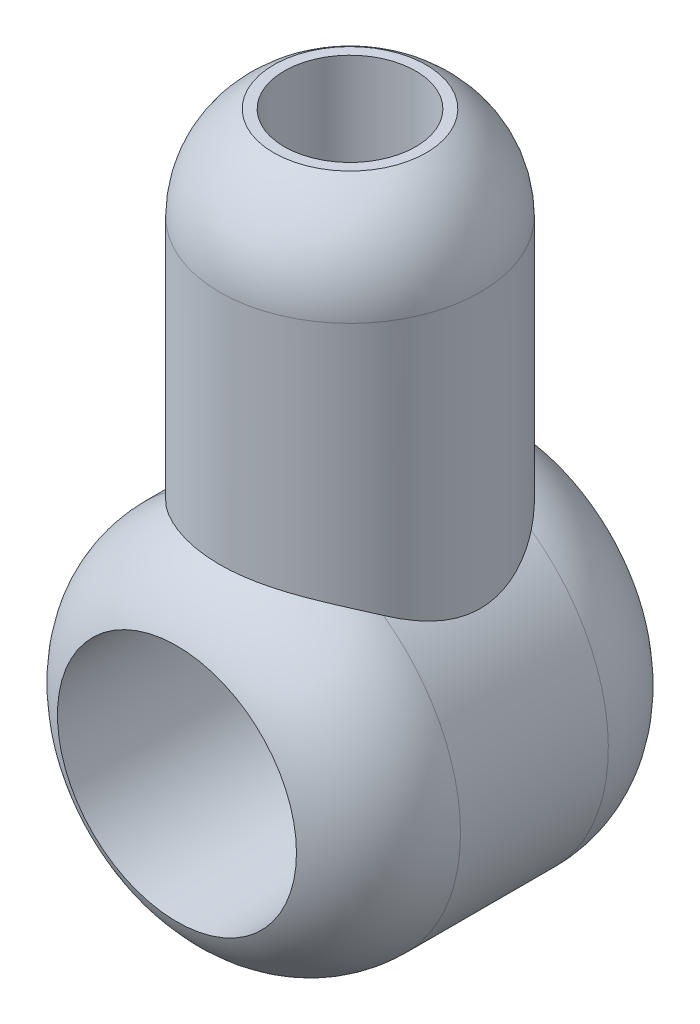
ISO-10303-21;
HEADER;
FILE_DESCRIPTION(('STEP AP214'),'2;1');
FILE_NAME('part.step','',(''),(''),'','','');
FILE_SCHEMA(('AUTOMOTIVE_DESIGN { 1 0 10303 214 1 1 1 1 }'));
ENDSEC;
DATA;
#1=APPLICATION_CONTEXT('core data for automotive mechanical design processes');
#2=APPLICATION_PROTOCOL_DEFINITION('international standard','automotive_design',2000,#1);
#3=PRODUCT_CONTEXT('',#1,'mechanical');
#4=PRODUCT('Part','Part','',(#3));
#5=PRODUCT_RELATED_PRODUCT_CATEGORY('part','',(#4));
#6=PRODUCT_DEFINITION_FORMATION('','',#4);
#7=PRODUCT_DEFINITION_CONTEXT('part definition',#1,'design');
#8=PRODUCT_DEFINITION('design','',#6,#7);
#9=PRODUCT_DEFINITION_SHAPE('','',#8);
#10=(LENGTH_UNIT() NAMED_UNIT(*) SI_UNIT(.MILLI.,.METRE.));
#11=(NAMED_UNIT(*) PLANE_ANGLE_UNIT() SI_UNIT($,.RADIAN.));
#12=(NAMED_UNIT(*) SI_UNIT($,.STERADIAN.) SOLID_ANGLE_UNIT());
#13=UNCERTAINTY_MEASURE_WITH_UNIT(LENGTH_MEASURE(1.E-05),#10,'distance_accuracy_value','');
#14=(GEOMETRIC_REPRESENTATION_CONTEXT(3) GLOBAL_UNCERTAINTY_ASSIGNED_CONTEXT((#13)) GLOBAL_UNIT_ASSIGNED_CONTEXT((#10,
#11,#12)) REPRESENTATION_CONTEXT('',''));
#15=CARTESIAN_POINT('',(0.,0.,0.));
#16=DIRECTION('',(0.,0.,1.));
#17=DIRECTION('',(1.,0.,0.));
#18=AXIS2_PLACEMENT_3D('',#15,#16,#17);
#19=CARTESIAN_POINT('',(0.,0.,32.));
#20=DIRECTION('',(0.,0.,-1.));
#21=DIRECTION('',(-1.,0.,0.));
#22=AXIS2_PLACEMENT_3D('',#19,#20,#21);
#23=CYLINDRICAL_SURFACE('',#22,17.05);
#24=CARTESIAN_POINT('',(-5.75325994545701,16.05,5.41215319340141));
#25=CARTESIAN_POINT('',(-6.0709622015275,15.9361150609495,5.5847885348256));
#26=CARTESIAN_POINT('',(-6.37893908821511,15.8150595662289,5.77066564026648));
#27=CARTESIAN_POINT('',(-6.97412039829839,15.5617758776052,6.16678710165));
#28=CARTESIAN_POINT('',(-7.26131120043666,15.4295404782977,6.37704720527926));
#29=CARTESIAN_POINT('',(-7.81476856856415,15.156760701865,6.82077684740627));
#30=CARTESIAN_POINT('',(-8.08095850363492,15.0161889024814,7.05432492759769));
#31=CARTESIAN_POINT('',(-8.59053429689587,14.7305979460112,7.54247629174245));
#32=CARTESIAN_POINT('',(-8.83392420550483,14.5855795849541,7.79707582072385));
#33=CARTESIAN_POINT('',(-9.29666056325181,14.2950695867743,8.32552209767579));
#34=CARTESIAN_POINT('',(-9.51607259894659,14.149580421585,8.5993127996148));
#35=CARTESIAN_POINT('',(-9.93092011977234,13.8615686839362,9.16606482382826));
#36=CARTESIAN_POINT('',(-10.126351668659,13.7190466016838,9.45902928128346));
#37=CARTESIAN_POINT('',(-10.4918127639937,13.4416105265195,10.0629381876041));
#38=CARTESIAN_POINT('',(-10.6618911179713,13.3066822349785,10.3738464484869));
#39=CARTESIAN_POINT('',(-10.9756290161075,13.0491088263368,11.0135326439348));
#40=CARTESIAN_POINT('',(-11.1192998903296,12.9264584517605,11.342302836071));
#41=CARTESIAN_POINT('',(-11.3403138900711,12.7324246440224,11.9177322751417));
#42=CARTESIAN_POINT('',(-11.4247486028286,12.6565591379813,12.160173315743));
#43=CARTESIAN_POINT('',(-11.578675040038,12.5158960603515,12.6528592622173));
#44=CARTESIAN_POINT('',(-11.6481710814409,12.4510952924104,12.9031018896017));
#45=CARTESIAN_POINT('',(-11.7712771666408,12.334776564709,13.4101201178402));
#46=CARTESIAN_POINT('',(-11.8249102154124,12.2832393839445,13.6668856658659));
#47=CARTESIAN_POINT('',(-11.9155781649766,12.1953065588592,14.1859211313491));
#48=CARTESIAN_POINT('',(-11.9526131867272,12.1589108041955,14.4481910086793));
#49=CARTESIAN_POINT('',(-12.0096035283787,12.1026260487855,14.9784504662014));
#50=CARTESIAN_POINT('',(-12.0294238942899,12.0828675113388,15.2464686553103));
#51=CARTESIAN_POINT('',(-12.0510646367305,12.061284413748,15.7839581871871));
#52=CARTESIAN_POINT('',(-12.0528853170313,12.0594595509465,16.0534295053546));
#53=CARTESIAN_POINT('',(-12.0384846180374,12.0738347672498,16.5914694476008));
#54=CARTESIAN_POINT('',(-12.0222584597961,12.0900396207675,16.8600378136768));
#55=CARTESIAN_POINT('',(-11.9721124607572,12.1396975669599,17.3938841298334));
#56=CARTESIAN_POINT('',(-11.9381925751495,12.1731507033167,17.6591620715792));
#57=CARTESIAN_POINT('',(-11.8574769717232,12.2517577013528,18.1587931512672));
#58=CARTESIAN_POINT('',(-11.8122618604883,12.2954501457973,18.3936367062798));
#59=CARTESIAN_POINT('',(-11.7085914584146,12.394212856462,18.8579782062637));
#60=CARTESIAN_POINT('',(-11.6501313609275,12.4492872525905,19.0874741771516));
#61=CARTESIAN_POINT('',(-11.4557910979389,12.6292714610968,19.7668433778254));
#62=CARTESIAN_POINT('',(-11.3009559393222,12.7689372137791,20.2075678297442));
#63=CARTESIAN_POINT('',(-10.9878663673396,13.0384544154787,20.9592258854074));
#64=CARTESIAN_POINT('',(-10.8390514204638,13.1628367447854,21.2762345136271));
#65=CARTESIAN_POINT('',(-10.5164435166123,13.4219866700257,21.8930463909786));
#66=CARTESIAN_POINT('',(-10.3426397456855,13.5567587503677,22.1928421121926));
#67=CARTESIAN_POINT('',(-9.97106931889549,13.8323490156372,22.7749342769112));
#68=CARTESIAN_POINT('',(-9.77326589257339,13.9731762591814,23.0572028404378));
#69=CARTESIAN_POINT('',(-9.354814935832,14.2567108081745,23.6031697276332));
#70=CARTESIAN_POINT('',(-9.13417117542822,14.3994177999698,23.8668711039591));
#71=CARTESIAN_POINT('',(-8.67933371963809,14.6778782373265,24.3654795599547));
#72=CARTESIAN_POINT('',(-8.44595199174549,14.8136925555634,24.601093652688));
#73=CARTESIAN_POINT('',(-7.95913662890107,15.0808398433551,25.0534544114146));
#74=CARTESIAN_POINT('',(-7.70570218296819,15.2121726313581,25.2702003135868));
#75=CARTESIAN_POINT('',(-7.1797859924512,15.4673358709428,25.6832226497217));
#76=CARTESIAN_POINT('',(-6.90733230588768,15.5911768911538,25.8795282150094));
#77=CARTESIAN_POINT('',(-6.34389191276889,15.8288017327014,26.2504260006739));
#78=CARTESIAN_POINT('',(-6.05290862340016,15.9425873992343,26.4250222072056));
#79=CARTESIAN_POINT('',(-5.50459379134485,16.1391373141338,26.7229682668495));
#80=CARTESIAN_POINT('',(-5.24996007900197,16.2238857147471,26.8499830218481));
#81=CARTESIAN_POINT('',(-4.72967840193952,16.3831199098284,27.0866715954695));
#82=CARTESIAN_POINT('',(-4.46403233865709,16.4576074664529,27.196348392123));
#83=CARTESIAN_POINT('',(-3.92298530778309,16.5948952382624,27.3971890694363));
#84=CARTESIAN_POINT('',(-3.64758763382822,16.6576993555809,27.4883591320618));
#85=CARTESIAN_POINT('',(-3.0884561325131,16.7703684075712,27.6511247510727));
#86=CARTESIAN_POINT('',(-2.80472221216816,16.8202331978533,27.7227200890244));
#87=CARTESIAN_POINT('',(-2.2293282142956,16.9061413216059,27.8456557204404));
#88=CARTESIAN_POINT('',(-1.93763594919361,16.9421152817211,27.8968943847641));
#89=CARTESIAN_POINT('',(-1.34981495407907,16.9990494973291,27.9778342327217));
#90=CARTESIAN_POINT('',(-1.05368621258351,17.0200097139546,28.0075353605997));
#91=CARTESIAN_POINT('',(-0.459339751248906,17.0464070693242,28.0449229844905));
#92=CARTESIAN_POINT('',(-0.161121973007487,17.0518437723333,28.0526088625494));
#93=CARTESIAN_POINT('',(0.434922185967846,17.0470569935959,28.0458357645322));
#94=CARTESIAN_POINT('',(0.73274858930604,17.0368344599884,28.0313781292062));
#95=CARTESIAN_POINT('',(1.30721360287202,17.0020974933798,27.9821366204943));
#96=CARTESIAN_POINT('',(1.5840225539971,16.9785069263518,27.9486663779762));
#97=CARTESIAN_POINT('',(2.13327157137646,16.9182735164202,27.8629216494001));
#98=CARTESIAN_POINT('',(2.40571153559743,16.8816303691491,27.8106467248436));
#99=CARTESIAN_POINT('',(2.94428640570089,16.7960702963766,27.6880239203993));
#100=CARTESIAN_POINT('',(3.21042596085684,16.7471627510714,27.6176898517326));
#101=CARTESIAN_POINT('',(3.7350695435192,16.638014980927,27.4597903442927));
#102=CARTESIAN_POINT('',(3.99357530610048,16.5777773545853,27.3722288563306));
#103=CARTESIAN_POINT('',(4.50865280782684,16.4452777310225,27.1782073004268));
#104=CARTESIAN_POINT('',(4.76498377430678,16.3727349319972,27.0713007110352));
#105=CARTESIAN_POINT('',(5.26714723104832,16.2181586963152,26.8413976051248));
#106=CARTESIAN_POINT('',(5.51298491989272,16.136130035651,26.7184091815312));
#107=CARTESIAN_POINT('',(6.0709622015275,15.9361150609495,26.4152114651744));
#108=CARTESIAN_POINT('',(6.37893908821511,15.8150595662289,26.2293343597335));
#109=CARTESIAN_POINT('',(6.97412039829839,15.5617758776052,25.83321289835));
#110=CARTESIAN_POINT('',(7.26131120043666,15.4295404782977,25.6229527947207));
#111=CARTESIAN_POINT('',(7.81476856856415,15.156760701865,25.1792231525937));
#112=CARTESIAN_POINT('',(8.08095850363492,15.0161889024814,24.9456750724023));
#113=CARTESIAN_POINT('',(8.59053429689587,14.7305979460112,24.4575237082575));
#114=CARTESIAN_POINT('',(8.83392420550483,14.5855795849541,24.2029241792762));
#115=CARTESIAN_POINT('',(9.29666056325181,14.2950695867743,23.6744779023242));
#116=CARTESIAN_POINT('',(9.51607259894659,14.149580421585,23.4006872003852));
#117=CARTESIAN_POINT('',(9.93092011977234,13.8615686839362,22.8339351761717));
#118=CARTESIAN_POINT('',(10.126351668659,13.7190466016838,22.5409707187165));
#119=CARTESIAN_POINT('',(10.4918127639937,13.4416105265195,21.9370618123959));
#120=CARTESIAN_POINT('',(10.6618911179713,13.3066822349785,21.6261535515131));
#121=CARTESIAN_POINT('',(10.9756290161075,13.0491088263368,20.9864673560652));
#122=CARTESIAN_POINT('',(11.1192998903296,12.9264584517605,20.657697163929));
#123=CARTESIAN_POINT('',(11.3403138900711,12.7324246440224,20.0822677248583));
#124=CARTESIAN_POINT('',(11.4247486028286,12.6565591379813,19.839826684257));
#125=CARTESIAN_POINT('',(11.578675040038,12.5158960603515,19.3471407377827));
#126=CARTESIAN_POINT('',(11.6481710814409,12.4510952924104,19.0968981103983));
#127=CARTESIAN_POINT('',(11.7712771666408,12.3347765647091,18.5898798821598));
#128=CARTESIAN_POINT('',(11.8249102154124,12.2832393839445,18.3331143341341));
#129=CARTESIAN_POINT('',(11.9155781649766,12.1953065588592,17.8140788686509));
#130=CARTESIAN_POINT('',(11.9526131867272,12.1589108041955,17.5518089913207));
#131=CARTESIAN_POINT('',(12.0096035283787,12.1026260487855,17.0215495337986));
#132=CARTESIAN_POINT('',(12.0294238942899,12.0828675113388,16.7535313446897));
#133=CARTESIAN_POINT('',(12.0510646367305,12.061284413748,16.2160418128129));
#134=CARTESIAN_POINT('',(12.0528853170313,12.0594595509465,15.9465704946454));
#135=CARTESIAN_POINT('',(12.0384846180374,12.0738347672498,15.4085305523993));
#136=CARTESIAN_POINT('',(12.0222584597961,12.0900396207675,15.1399621863232));
#137=CARTESIAN_POINT('',(11.9721124607572,12.1396975669599,14.6061158701666));
#138=CARTESIAN_POINT('',(11.9381925751495,12.1731507033167,14.3408379284208));
#139=CARTESIAN_POINT('',(11.8574769717232,12.2517577013528,13.8412068487328));
#140=CARTESIAN_POINT('',(11.8122618604883,12.2954501457973,13.6063632937202));
#141=CARTESIAN_POINT('',(11.7085914584146,12.394212856462,13.1420217937363));
#142=CARTESIAN_POINT('',(11.6501313609275,12.4492872525905,12.9125258228484));
#143=CARTESIAN_POINT('',(11.4557910979389,12.6292714610968,12.2331566221746));
#144=CARTESIAN_POINT('',(11.3009559393222,12.7689372137791,11.7924321702558));
#145=CARTESIAN_POINT('',(10.9878663673396,13.0384544154787,11.0407741145926));
#146=CARTESIAN_POINT('',(10.8390514204638,13.1628367447854,10.7237654863729));
#147=CARTESIAN_POINT('',(10.5164435166123,13.4219866700257,10.1069536090214));
#148=CARTESIAN_POINT('',(10.3426397456855,13.5567587503677,9.80715788780739));
#149=CARTESIAN_POINT('',(9.97106931889549,13.8323490156372,9.22506572308883));
#150=CARTESIAN_POINT('',(9.77326589257339,13.9731762591814,8.94279715956224));
#151=CARTESIAN_POINT('',(9.35481493583199,14.2567108081745,8.39683027236676));
#152=CARTESIAN_POINT('',(9.13417117542821,14.3994177999698,8.1331288960409));
#153=CARTESIAN_POINT('',(8.67933371963809,14.6778782373265,7.63452044004529));
#154=CARTESIAN_POINT('',(8.44595199174549,14.8136925555634,7.39890634731198));
#155=CARTESIAN_POINT('',(7.95913662890107,15.0808398433551,6.94654558858538));
#156=CARTESIAN_POINT('',(7.70570218296819,15.2121726313581,6.72979968641323));
#157=CARTESIAN_POINT('',(7.17978599245119,15.4673358709428,6.31677735027828));
#158=CARTESIAN_POINT('',(6.90733230588768,15.5911768911538,6.12047178499063));
#159=CARTESIAN_POINT('',(6.34389191276889,15.8288017327014,5.74957399932614));
#160=CARTESIAN_POINT('',(6.05290862340016,15.9425873992343,5.57497779279444));
#161=CARTESIAN_POINT('',(5.50459379134485,16.1391373141338,5.27703173315054));
#162=CARTESIAN_POINT('',(5.24996007900198,16.2238857147471,5.15001697815193));
#163=CARTESIAN_POINT('',(4.72967840193953,16.3831199098284,4.9133284045305));
#164=CARTESIAN_POINT('',(4.46403233865709,16.4576074664529,4.80365160787704));
#165=CARTESIAN_POINT('',(3.92298530778309,16.5948952382624,4.60281093056375));
#166=CARTESIAN_POINT('',(3.64758763382822,16.6576993555809,4.51164086793819));
#167=CARTESIAN_POINT('',(3.0884561325131,16.7703684075712,4.34887524892735));
#168=CARTESIAN_POINT('',(2.80472221216816,16.8202331978533,4.27727991097556));
#169=CARTESIAN_POINT('',(2.2293282142956,16.9061413216059,4.15434427955963));
#170=CARTESIAN_POINT('',(1.93763594919361,16.9421152817211,4.10310561523588));
#171=CARTESIAN_POINT('',(1.34981495407907,16.9990494973291,4.02216576727827));
#172=CARTESIAN_POINT('',(1.0536862125835,17.0200097139546,3.99246463940026));
#173=CARTESIAN_POINT('',(0.459339751248897,17.0464070693242,3.95507701550951));
#174=CARTESIAN_POINT('',(0.161121973007479,17.0518437723333,3.94739113745056));
#175=CARTESIAN_POINT('',(-0.434922185967851,17.0470569935959,3.95416423546785));
#176=CARTESIAN_POINT('',(-0.732748589306042,17.0368344599884,3.96862187079376));
#177=CARTESIAN_POINT('',(-1.30721360287202,17.0020974933798,4.01786337950572));
#178=CARTESIAN_POINT('',(-1.5840225539971,16.9785069263518,4.05133362202376));
#179=CARTESIAN_POINT('',(-2.13327157137646,16.9182735164202,4.13707835059991));
#180=CARTESIAN_POINT('',(-2.40571153559743,16.8816303691491,4.18935327515642));
#181=CARTESIAN_POINT('',(-2.94428640570089,16.7960702963766,4.31197607960072));
#182=CARTESIAN_POINT('',(-3.21042596085684,16.7471627510714,4.38231014826743));
#183=CARTESIAN_POINT('',(-3.7350695435192,16.638014980927,4.54020965570728));
#184=CARTESIAN_POINT('',(-3.99357530610048,16.5777773545853,4.6277711436694));
#185=CARTESIAN_POINT('',(-4.50865280782684,16.4452777310225,4.82179269957316));
#186=CARTESIAN_POINT('',(-4.76498377430678,16.3727349319972,4.92869928896483));
#187=CARTESIAN_POINT('',(-5.26714723104832,16.2181586963152,5.15860239487523));
#188=CARTESIAN_POINT('',(-5.51298491989272,16.136130035651,5.28159081846884));
#189=CARTESIAN_POINT('',(-5.75325994545701,16.05,5.41215319340141));
#190=B_SPLINE_CURVE_WITH_KNOTS('',3,(#24,#25,#26,#27,#28,#29,#30,#31,#32,#33,#34,#35,#36,#37,
#38,#39,#40,#41,#42,#43,#44,#45,#46,#47,#48,#49,#50,#51,#52,#53,#54,#55,#56,#57,#58,#59,#60,#61,
#62,#63,#64,#65,#66,#67,#68,#69,#70,#71,#72,#73,#74,#75,#76,#77,#78,#79,#80,#81,#82,#83,#84,#85,
#86,#87,#88,#89,#90,#91,#92,#93,#94,#95,#96,#97,#98,#99,#100,#101,#102,#103,#104,#105,#106,#107,
#108,#109,#110,#111,#112,#113,#114,#115,#116,#117,#118,#119,#120,#121,#122,#123,#124,#125,#126,
#127,#128,#129,#130,#131,#132,#133,#134,#135,#136,#137,#138,#139,#140,#141,#142,#143,#144,#145,
#146,#147,#148,#149,#150,#151,#152,#153,#154,#155,#156,#157,#158,#159,#160,#161,#162,#163,#164,
#165,#166,#167,#168,#169,#170,#171,#172,#173,#174,#175,#176,#177,#178,#179,#180,#181,#182,#183,
#184,#185,#186,#187,#188,#189),.UNSPECIFIED.,.T.,.F.,(4,2,2,2,2,2,2,2,2,2,2,2,2,2,2,2,2,2,2,2,2,
2,2,2,2,2,2,2,2,2,2,2,2,2,2,2,2,2,2,2,2,2,2,2,2,2,2,2,2,2,2,2,2,2,2,2,2,2,2,2,2,2,2,2,2,2,2,2,2,
2,2,2,2,2,2,2,2,2,2,2,2,2,4),(0.,1.1369533347103,2.27464510033378,3.41631273503319,
4.55777716661514,5.69603678794917,6.8344829981303,7.97070846413988,9.10644529166786,
9.90887650335207,10.7110755171967,11.5121053891977,12.3131294236071,13.1203778137818,
13.9276125804219,14.7350611601642,15.5425117848122,16.2711215749163,16.9999962046187,
18.4578372924048,19.571459781075,20.6855656502529,21.8014005500687,22.9170515634586,
23.9911045783453,25.0652010527917,26.1377451593529,27.2100920394441,28.0999887557481,
28.9897324536916,29.8791784519273,30.7686343750467,31.6624766590425,32.5563212569867,
33.450190944324,34.3440065115819,35.182493249865,36.0209995417323,36.8588664633285,
37.6965414581254,38.5568391233983,39.4167055119528,40.5536588466631,41.6913506122865,
42.8330182469859,43.9744826785679,45.1127422999019,46.2511885100831,47.3874139760926,
48.5231508036206,49.3255820153048,50.1277810291495,50.9288109011504,51.7298349355598,
52.5370833257346,53.3443180923747,54.1517666721169,54.9592172967649,55.687827086869,
56.4167017165714,57.8745428043576,58.9881652930278,60.1022711622056,61.2181060620215,
62.3337570754113,63.407810090298,64.4819065647444,65.5544506713057,66.6267975513968,
67.5166942677008,68.4064379656443,69.29588396388,70.1853398869995,71.0791821709953,
71.9730267689395,72.8668964562767,73.7607120235347,74.5991987618177,75.437705053685,
76.2755719752813,77.1132469700782,77.9735446353511,78.8334110239055),.UNSPECIFIED.);
#191=CARTESIAN_POINT('',(-9.92407902412983,13.8641680429381,9.16515138991168));
#192=VERTEX_POINT('',#191);
#193=CARTESIAN_POINT('',(-9.92407902412984,13.8641680429381,22.8348486100883));
#194=VERTEX_POINT('',#193);
#195=EDGE_CURVE('E66',#192,#194,#190,.T.);
#196=ORIENTED_EDGE('',*,*,#195,.F.);
#197=CARTESIAN_POINT('',(0.,0.,9.16515138991168));
#198=DIRECTION('',(0.,0.,-1.));
#199=DIRECTION('',(-1.,0.,0.));
#200=AXIS2_PLACEMENT_3D('',#197,#198,#199);
#201=CIRCLE('',#200,17.05);
#202=CARTESIAN_POINT('',(9.92407902412983,13.8641680429381,9.16515138991168));
#203=VERTEX_POINT('',#202);
#204=EDGE_CURVE('E68',#192,#203,#201,.F.);
#205=ORIENTED_EDGE('',*,*,#204,.T.);
#206=CARTESIAN_POINT('',(9.92407902412983,13.8641680429381,22.8348486100883));
#207=VERTEX_POINT('',#206);
#208=EDGE_CURVE('E67',#207,#203,#190,.T.);
#209=ORIENTED_EDGE('',*,*,#208,.F.);
#210=CARTESIAN_POINT('',(0.,0.,22.8348486100883));
#211=DIRECTION('',(0.,0.,1.));
#212=DIRECTION('',(1.,0.,0.));
#213=AXIS2_PLACEMENT_3D('',#210,#211,#212);
#214=CIRCLE('',#213,17.05);
#215=EDGE_CURVE('E73',#207,#194,#214,.F.);
#216=ORIENTED_EDGE('',*,*,#215,.T.);
#217=EDGE_LOOP('',(#196,#205,#209,#216));
#218=FACE_BOUND('',#217,.T.);
#219=ADVANCED_FACE('F37',(#218),#23,.T.);
#220=CARTESIAN_POINT('',(0.,16.05,16.));
#221=DIRECTION('',(0.,-1.,0.));
#222=DIRECTION('',(0.,0.,-1.));
#223=AXIS2_PLACEMENT_3D('',#220,#221,#222);
#224=CYLINDRICAL_SURFACE('',#223,12.05);
#225=CARTESIAN_POINT('',(0.,37.3897459621556,16.));
#226=DIRECTION('',(0.,1.,0.));
#227=DIRECTION('',(0.,0.,1.));
#228=AXIS2_PLACEMENT_3D('',#225,#226,#227);
#229=CIRCLE('',#228,12.05);
#230=CARTESIAN_POINT('',(0.,37.3897459621556,28.05));
#231=VERTEX_POINT('',#230);
#232=EDGE_CURVE('E78',#231,#231,#229,.F.);
#233=ORIENTED_EDGE('',*,*,#232,.T.);
#234=EDGE_LOOP('',(#233));
#235=FACE_BOUND('',#234,.T.);
#236=ORIENTED_EDGE('',*,*,#195,.T.);
#237=CARTESIAN_POINT('',(-9.92407902412983,13.8641680429381,22.8348486100883));
#238=CARTESIAN_POINT('',(-9.84178062513112,13.9230794027315,22.9543477480161));
#239=CARTESIAN_POINT('',(-9.75689534416725,13.9800961383421,23.0729746715142));
#240=CARTESIAN_POINT('',(-9.58200448481592,14.0904199426956,23.3081571825757));
#241=CARTESIAN_POINT('',(-9.4919989980806,14.1437270778026,23.4247128071666));
#242=CARTESIAN_POINT('',(-9.21444076457105,14.2981715107522,23.7707103608655));
#243=CARTESIAN_POINT('',(-9.01929023815051,14.3938717652557,23.9965646290662));
#244=CARTESIAN_POINT('',(-8.61030363240758,14.5711545760404,24.4353378889131));
#245=CARTESIAN_POINT('',(-8.39651748727289,14.6527732138944,24.648289004924));
#246=CARTESIAN_POINT('',(-7.9510437201552,14.803041466858,25.0595409742489));
#247=CARTESIAN_POINT('',(-7.71935645553837,14.8716913407733,25.2578421198708));
#248=CARTESIAN_POINT('',(-7.23947389108208,14.9970135407359,25.6377498180987));
#249=CARTESIAN_POINT('',(-6.99127154427942,15.0536807101306,25.8193491643118));
#250=CARTESIAN_POINT('',(-6.48012517819473,15.1560953652206,26.1639306051884));
#251=CARTESIAN_POINT('',(-6.21718070854087,15.2018425170848,26.3269121306149));
#252=CARTESIAN_POINT('',(-5.678341336506,15.2836065319165,26.6327289750644));
#253=CARTESIAN_POINT('',(-5.40244467485093,15.3196220685409,26.775561546676));
#254=CARTESIAN_POINT('',(-4.8396368297126,15.3831522589197,27.0397946606847));
#255=CARTESIAN_POINT('',(-4.55272553138371,15.4106668240104,27.1611949795416));
#256=CARTESIAN_POINT('',(-3.96388136775069,15.4589117193688,27.383814387215));
#257=CARTESIAN_POINT('',(-3.66176144195105,15.4794921493988,27.4845710936342));
#258=CARTESIAN_POINT('',(-3.05015717450437,15.514299574473,27.6619221285863));
#259=CARTESIAN_POINT('',(-2.74067272598234,15.5285264772546,27.738516106236));
#260=CARTESIAN_POINT('',(-2.11630350212431,15.5516692439622,27.8669871066563));
#261=CARTESIAN_POINT('',(-1.80141676863328,15.5605831383837,27.9188549621581));
#262=CARTESIAN_POINT('',(-1.16842570899568,15.5738581759532,27.9974582081107));
#263=CARTESIAN_POINT('',(-0.850321313225298,15.5782192203729,28.0241930535523));
#264=CARTESIAN_POINT('',(-0.200567086305651,15.5828964876073,28.0528870583858));
#265=CARTESIAN_POINT('',(0.131128662135652,15.5830489081433,28.0538428485543));
#266=CARTESIAN_POINT('',(0.793449698689026,15.5789099977686,28.0284152443861));
#267=CARTESIAN_POINT('',(1.12407495608431,15.5746185404585,28.0020310724068));
#268=CARTESIAN_POINT('',(1.78191380344921,15.5611461086578,27.9221246980747));
#269=CARTESIAN_POINT('',(2.10912758631842,15.5519654121716,27.8686040387239));
#270=CARTESIAN_POINT('',(2.75783378692662,15.527859756474,27.734842467907));
#271=CARTESIAN_POINT('',(3.07932624897944,15.512934841774,27.6546017634929));
#272=CARTESIAN_POINT('',(3.71618209433755,15.4760573934214,27.4674887623007));
#273=CARTESIAN_POINT('',(4.03149664182963,15.4540628975342,27.3604583135205));
#274=CARTESIAN_POINT('',(4.65160356336997,15.4016703797597,27.1209511357621));
#275=CARTESIAN_POINT('',(4.95639575716608,15.3712722139945,26.9884739711264));
#276=CARTESIAN_POINT('',(5.5531618901421,15.3005654627858,26.6992921208724));
#277=CARTESIAN_POINT('',(5.84513289259456,15.2602546206293,26.5425819213975));
#278=CARTESIAN_POINT('',(6.41386432509232,15.1682310014105,26.2065623313025));
#279=CARTESIAN_POINT('',(6.6906259245229,15.1165191024628,26.0272546816036));
#280=CARTESIAN_POINT('',(7.2185712916291,15.0020566223147,25.6538106657678));
#281=CARTESIAN_POINT('',(7.47027853601921,14.9396921529744,25.4602957863389));
#282=CARTESIAN_POINT('',(7.95560424729751,14.8017346152724,25.0559711255544));
#283=CARTESIAN_POINT('',(8.18922010698194,14.7261396453221,24.845158860403));
#284=CARTESIAN_POINT('',(8.63627715978674,14.5608861377223,24.4091925342811));
#285=CARTESIAN_POINT('',(8.84975910810739,14.4712570315788,24.1840690599085));
#286=CARTESIAN_POINT('',(9.25575733997994,14.2770042932956,23.7219132820398));
#287=CARTESIAN_POINT('',(9.44828740565953,14.1723906241919,23.4848889587316));
#288=CARTESIAN_POINT('',(9.68065651481264,14.028554042439,23.175969700058));
#289=CARTESIAN_POINT('',(9.73056287515367,13.996524375124,23.108143603383));
#290=CARTESIAN_POINT('',(9.8286215682539,13.9312604080698,22.971924007815));
#291=CARTESIAN_POINT('',(9.87677559175822,13.8980273347387,22.9035311384713));
#292=CARTESIAN_POINT('',(9.92407902412984,13.8641680429381,22.8348486100883));
#293=B_SPLINE_CURVE_WITH_KNOTS('',3,(#237,#238,#239,#240,#241,#242,#243,#244,#245,#246,#247,
#248,#249,#250,#251,#252,#253,#254,#255,#256,#257,#258,#259,#260,#261,#262,#263,#264,#265,#266,
#267,#268,#269,#270,#271,#272,#273,#274,#275,#276,#277,#278,#279,#280,#281,#282,#283,#284,#285,
#286,#287,#288,#289,#290,#291,#292),.UNSPECIFIED.,.F.,.F.,(4,2,2,2,2,2,2,2,2,2,2,2,2,2,2,2,2,2,
2,2,2,2,2,2,2,2,2,4),(0.,0.469727470112293,0.939446534704973,1.87856541102471,2.81524102745597,
3.75189794954014,4.68895713714068,5.62604496751319,6.56326045128487,7.50048570971815,
8.45683645423944,9.41320108593188,10.3699200168669,11.3266596937701,12.3205858911768,
13.314540360045,14.3084383182211,15.3023285749215,16.302230623563,17.3021497924376,
18.3022968133192,19.3023668293235,20.2718412350093,21.2414550955616,22.2090621249344,
23.1760287661789,23.4462935487048,23.7162902512957),.UNSPECIFIED.);
#294=EDGE_CURVE('E46',#194,#207,#293,.T.);
#295=ORIENTED_EDGE('',*,*,#294,.T.);
#296=ORIENTED_EDGE('',*,*,#208,.T.);
#297=CARTESIAN_POINT('',(9.92407902412983,13.8641680429381,9.16515138991168));
#298=CARTESIAN_POINT('',(9.84178062513112,13.9230794027315,9.04565225198392));
#299=CARTESIAN_POINT('',(9.75689534416725,13.9800961383421,8.92702532848581));
#300=CARTESIAN_POINT('',(9.58200448481592,14.0904199426956,8.6918428174243));
#301=CARTESIAN_POINT('',(9.4919989980806,14.1437270778026,8.57528719283344));
#302=CARTESIAN_POINT('',(9.21444076457105,14.2981715107522,8.22928963913449));
#303=CARTESIAN_POINT('',(9.01929023815051,14.3938717652557,8.00343537093379));
#304=CARTESIAN_POINT('',(8.61030363240758,14.5711545760405,7.56466211108693));
#305=CARTESIAN_POINT('',(8.39651748727289,14.6527732138944,7.35171099507599));
#306=CARTESIAN_POINT('',(7.95104372015519,14.803041466858,6.94045902575105));
#307=CARTESIAN_POINT('',(7.71935645553837,14.8716913407733,6.7421578801292));
#308=CARTESIAN_POINT('',(7.23947389108208,14.9970135407359,6.36225018190133));
#309=CARTESIAN_POINT('',(6.99127154427942,15.0536807101306,6.18065083568815));
#310=CARTESIAN_POINT('',(6.48012517819472,15.1560953652206,5.83606939481158));
#311=CARTESIAN_POINT('',(6.21718070854086,15.2018425170848,5.6730878693851));
#312=CARTESIAN_POINT('',(5.67834133650599,15.2836065319165,5.36727102493556));
#313=CARTESIAN_POINT('',(5.40244467485093,15.3196220685409,5.224438453324));
#314=CARTESIAN_POINT('',(4.8396368297126,15.3831522589197,4.96020533931529));
#315=CARTESIAN_POINT('',(4.5527255313837,15.4106668240104,4.8388050204584));
#316=CARTESIAN_POINT('',(3.96388136775068,15.4589117193688,4.61618561278502));
#317=CARTESIAN_POINT('',(3.66176144195104,15.4794921493988,4.51542890636575));
#318=CARTESIAN_POINT('',(3.05015717450436,15.514299574473,4.33807787141365));
#319=CARTESIAN_POINT('',(2.74067272598233,15.5285264772546,4.26148389376401));
#320=CARTESIAN_POINT('',(2.1163035021243,15.5516692439622,4.13301289334366));
#321=CARTESIAN_POINT('',(1.80141676863327,15.5605831383838,4.08114503784187));
#322=CARTESIAN_POINT('',(1.16842570899567,15.5738581759532,4.00254179188927));
#323=CARTESIAN_POINT('',(0.85032131322529,15.5782192203729,3.9758069464477));
#324=CARTESIAN_POINT('',(0.200567086305644,15.5828964876073,3.94711294161424));
#325=CARTESIAN_POINT('',(-0.13112866213566,15.5830489081433,3.94615715144574));
#326=CARTESIAN_POINT('',(-0.793449698689034,15.5789099977686,3.97158475561388));
#327=CARTESIAN_POINT('',(-1.12407495608432,15.5746185404585,3.99796892759325));
#328=CARTESIAN_POINT('',(-1.78191380344922,15.5611461086578,4.07787530192529));
#329=CARTESIAN_POINT('',(-2.10912758631843,15.5519654121717,4.13139596127606));
#330=CARTESIAN_POINT('',(-2.75783378692663,15.527859756474,4.26515753209297));
#331=CARTESIAN_POINT('',(-3.07932624897945,15.512934841774,4.34539823650713));
#332=CARTESIAN_POINT('',(-3.71618209433756,15.4760573934214,4.53251123769927));
#333=CARTESIAN_POINT('',(-4.03149664182964,15.4540628975342,4.63954168647953));
#334=CARTESIAN_POINT('',(-4.65160356336997,15.4016703797597,4.87904886423791));
#335=CARTESIAN_POINT('',(-4.95639575716608,15.3712722139945,5.01152602887358));
#336=CARTESIAN_POINT('',(-5.55316189014211,15.3005654627858,5.30070787912756));
#337=CARTESIAN_POINT('',(-5.84513289259457,15.2602546206293,5.45741807860252));
#338=CARTESIAN_POINT('',(-6.41386432509233,15.1682310014105,5.79343766869751));
#339=CARTESIAN_POINT('',(-6.69062592452291,15.1165191024628,5.97274531839642));
#340=CARTESIAN_POINT('',(-7.2185712916291,15.0020566223147,6.34618933423219));
#341=CARTESIAN_POINT('',(-7.47027853601922,14.9396921529744,6.53970421366106));
#342=CARTESIAN_POINT('',(-7.95560424729751,14.8017346152724,6.94402887444563));
#343=CARTESIAN_POINT('',(-8.18922010698195,14.7261396453221,7.15484113959701));
#344=CARTESIAN_POINT('',(-8.63627715978675,14.5608861377223,7.59080746571886));
#345=CARTESIAN_POINT('',(-8.8497591081074,14.4712570315788,7.8159309400915));
#346=CARTESIAN_POINT('',(-9.25575733997995,14.2770042932956,8.27808671796025));
#347=CARTESIAN_POINT('',(-9.44828740565953,14.1723906241919,8.51511104126841));
#348=CARTESIAN_POINT('',(-9.68065651481264,14.028554042439,8.82403029994206));
#349=CARTESIAN_POINT('',(-9.73056287515367,13.996524375124,8.89185639661704));
#350=CARTESIAN_POINT('',(-9.8286215682539,13.9312604080698,9.02807599218496));
#351=CARTESIAN_POINT('',(-9.87677559175822,13.8980273347386,9.09646886152871));
#352=CARTESIAN_POINT('',(-9.92407902412984,13.8641680429381,9.16515138991167));
#353=B_SPLINE_CURVE_WITH_KNOTS('',3,(#297,#298,#299,#300,#301,#302,#303,#304,#305,#306,#307,
#308,#309,#310,#311,#312,#313,#314,#315,#316,#317,#318,#319,#320,#321,#322,#323,#324,#325,#326,
#327,#328,#329,#330,#331,#332,#333,#334,#335,#336,#337,#338,#339,#340,#341,#342,#343,#344,#345,
#346,#347,#348,#349,#350,#351,#352),.UNSPECIFIED.,.F.,.F.,(4,2,2,2,2,2,2,2,2,2,2,2,2,2,2,2,2,2,
2,2,2,2,2,2,2,2,2,4),(0.,0.469727470112295,0.939446534704973,1.87856541102471,2.81524102745596,
3.75189794954014,4.68895713714068,5.6260449675132,6.56326045128487,7.50048570971815,
8.45683645423944,9.41320108593188,10.3699200168669,11.3266596937701,12.3205858911768,
13.314540360045,14.3084383182211,15.3023285749215,16.302230623563,17.3021497924376,
18.3022968133192,19.3023668293235,20.2718412350093,21.2414550955616,22.2090621249344,
23.1760287661789,23.4462935487048,23.7162902512957),.UNSPECIFIED.);
#354=EDGE_CURVE('E52',#203,#192,#353,.T.);
#355=ORIENTED_EDGE('',*,*,#354,.T.);
#356=EDGE_LOOP('',(#236,#295,#296,#355));
#357=FACE_BOUND('',#356,.T.);
#358=ADVANCED_FACE('F65',(#235,#357),#224,.T.);
#359=CARTESIAN_POINT('',(0.,0.,32.));
#360=DIRECTION('',(0.,0.,-1.));
#361=DIRECTION('',(-1.,0.,0.));
#362=AXIS2_PLACEMENT_3D('',#359,#360,#361);
#363=CYLINDRICAL_SURFACE('',#362,11.05);
#364=CARTESIAN_POINT('',(0.,0.,32.));
#365=DIRECTION('',(0.,0.,1.));
#366=DIRECTION('',(1.,0.,0.));
#367=AXIS2_PLACEMENT_3D('',#364,#365,#366);
#368=CIRCLE('',#367,11.05);
#369=CARTESIAN_POINT('',(11.05,0.,32.));
#370=VERTEX_POINT('',#369);
#371=EDGE_CURVE('E111',#370,#370,#368,.T.);
#372=ORIENTED_EDGE('',*,*,#371,.T.);
#373=EDGE_LOOP('',(#372));
#374=FACE_BOUND('',#373,.T.);
#375=CARTESIAN_POINT('',(0.,0.,0.));
#376=DIRECTION('',(0.,0.,1.));
#377=DIRECTION('',(1.,0.,0.));
#378=AXIS2_PLACEMENT_3D('',#375,#376,#377);
#379=CIRCLE('',#378,11.05);
#380=CARTESIAN_POINT('',(11.05,0.,0.));
#381=VERTEX_POINT('',#380);
#382=EDGE_CURVE('E74',#381,#381,#379,.T.);
#383=ORIENTED_EDGE('',*,*,#382,.F.);
#384=EDGE_LOOP('',(#383));
#385=FACE_BOUND('',#384,.T.);
#386=ADVANCED_FACE('F100',(#374,#385),#363,.F.);
#387=CARTESIAN_POINT('',(0.,37.3897459621556,16.));
#388=DIRECTION('',(0.,1.,0.));
#389=DIRECTION('',(0.,0.,1.));
#390=AXIS2_PLACEMENT_3D('',#387,#388,#389);
#391=DEGENERATE_TOROIDAL_SURFACE('',#390,2.05,10.,.T.);
#392=ORIENTED_EDGE('',*,*,#232,.F.);
#393=EDGE_LOOP('',(#392));
#394=FACE_BOUND('',#393,.T.);
#395=CARTESIAN_POINT('',(0.,46.05,16.));
#396=DIRECTION('',(0.,1.,0.));
#397=DIRECTION('',(0.,0.,1.));
#398=AXIS2_PLACEMENT_3D('',#395,#396,#397);
#399=CIRCLE('',#398,7.05);
#400=CARTESIAN_POINT('',(0.,46.05,23.05));
#401=VERTEX_POINT('',#400);
#402=EDGE_CURVE('E109',#401,#401,#399,.T.);
#403=ORIENTED_EDGE('',*,*,#402,.F.);
#404=EDGE_LOOP('',(#403));
#405=FACE_BOUND('',#404,.T.);
#406=ADVANCED_FACE('F96',(#394,#405),#391,.T.);
#407=CARTESIAN_POINT('',(0.,0.,9.16515138991168));
#408=DIRECTION('',(0.,0.,-1.));
#409=DIRECTION('',(-1.,0.,0.));
#410=AXIS2_PLACEMENT_3D('',#407,#408,#409);
#411=DEGENERATE_TOROIDAL_SURFACE('',#410,7.05,10.,.T.);
#412=ORIENTED_EDGE('',*,*,#382,.T.);
#413=EDGE_LOOP('',(#412));
#414=FACE_BOUND('',#413,.T.);
#415=ORIENTED_EDGE('',*,*,#354,.F.);
#416=ORIENTED_EDGE('',*,*,#204,.F.);
#417=EDGE_LOOP('',(#415,#416));
#418=FACE_BOUND('',#417,.T.);
#419=ADVANCED_FACE('F76',(#414,#418),#411,.T.);
#420=CARTESIAN_POINT('',(0.,0.,22.8348486100883));
#421=DIRECTION('',(0.,0.,1.));
#422=DIRECTION('',(1.,0.,0.));
#423=AXIS2_PLACEMENT_3D('',#420,#421,#422);
#424=DEGENERATE_TOROIDAL_SURFACE('',#423,7.05,10.,.T.);
#425=ORIENTED_EDGE('',*,*,#294,.F.);
#426=ORIENTED_EDGE('',*,*,#215,.F.);
#427=EDGE_LOOP('',(#425,#426));
#428=FACE_BOUND('',#427,.T.);
#429=ORIENTED_EDGE('',*,*,#371,.F.);
#430=EDGE_LOOP('',(#429));
#431=FACE_BOUND('',#430,.T.);
#432=ADVANCED_FACE('F39',(#428,#431),#424,.T.);
#433=CARTESIAN_POINT('',(0.,46.05,16.));
#434=DIRECTION('',(0.,1.,0.));
#435=DIRECTION('',(0.,0.,1.));
#436=AXIS2_PLACEMENT_3D('',#433,#434,#435);
#437=PLANE('',#436);
#438=ORIENTED_EDGE('',*,*,#402,.T.);
#439=EDGE_LOOP('',(#438));
#440=FACE_BOUND('',#439,.T.);
#441=CARTESIAN_POINT('',(0.,46.05,16.));
#442=DIRECTION('',(0.,1.,0.));
#443=DIRECTION('',(0.,0.,1.));
#444=AXIS2_PLACEMENT_3D('',#441,#442,#443);
#445=CIRCLE('',#444,6.075);
#446=CARTESIAN_POINT('',(0.,46.05,22.075));
#447=VERTEX_POINT('',#446);
#448=EDGE_CURVE('E122',#447,#447,#445,.T.);
#449=ORIENTED_EDGE('',*,*,#448,.F.);
#450=EDGE_LOOP('',(#449));
#451=FACE_BOUND('',#450,.T.);
#452=ADVANCED_FACE('F129',(#440,#451),#437,.T.);
#453=CARTESIAN_POINT('',(0.,46.05,16.));
#454=DIRECTION('',(0.,-1.,0.));
#455=DIRECTION('',(0.,0.,-1.));
#456=AXIS2_PLACEMENT_3D('',#453,#454,#455);
#457=CYLINDRICAL_SURFACE('',#456,6.075);
#458=ORIENTED_EDGE('',*,*,#448,.T.);
#459=EDGE_LOOP('',(#458));
#460=FACE_BOUND('',#459,.T.);
#461=CARTESIAN_POINT('',(0.,16.05,16.));
#462=DIRECTION('',(0.,1.,0.));
#463=DIRECTION('',(0.,0.,1.));
#464=AXIS2_PLACEMENT_3D('',#461,#462,#463);
#465=CIRCLE('',#464,6.075);
#466=CARTESIAN_POINT('',(0.,16.05,22.075));
#467=VERTEX_POINT('',#466);
#468=EDGE_CURVE('E11',#467,#467,#465,.F.);
#469=ORIENTED_EDGE('',*,*,#468,.T.);
#470=EDGE_LOOP('',(#469));
#471=FACE_BOUND('',#470,.T.);
#472=ADVANCED_FACE('F126',(#460,#471),#457,.F.);
#473=CARTESIAN_POINT('',(0.,16.05,0.));
#474=DIRECTION('',(0.,1.,0.));
#475=DIRECTION('',(0.,0.,1.));
#476=AXIS2_PLACEMENT_3D('',#473,#474,#475);
#477=PLANE('',#476);
#478=ORIENTED_EDGE('',*,*,#468,.F.);
#479=EDGE_LOOP('',(#478));
#480=FACE_BOUND('',#479,.T.);
#481=ADVANCED_FACE('F136',(#480),#477,.T.);
#482=CLOSED_SHELL('',(#219,#358,#386,#406,#419,#432,#452,#472,#481));
#483=MANIFOLD_SOLID_BREP('B2',#482);
#484=ADVANCED_BREP_SHAPE_REPRESENTATION('',(#18,#483),#14);
#485=SHAPE_DEFINITION_REPRESENTATION(#9,#484);
ENDSEC;
END-ISO-10303-21;
